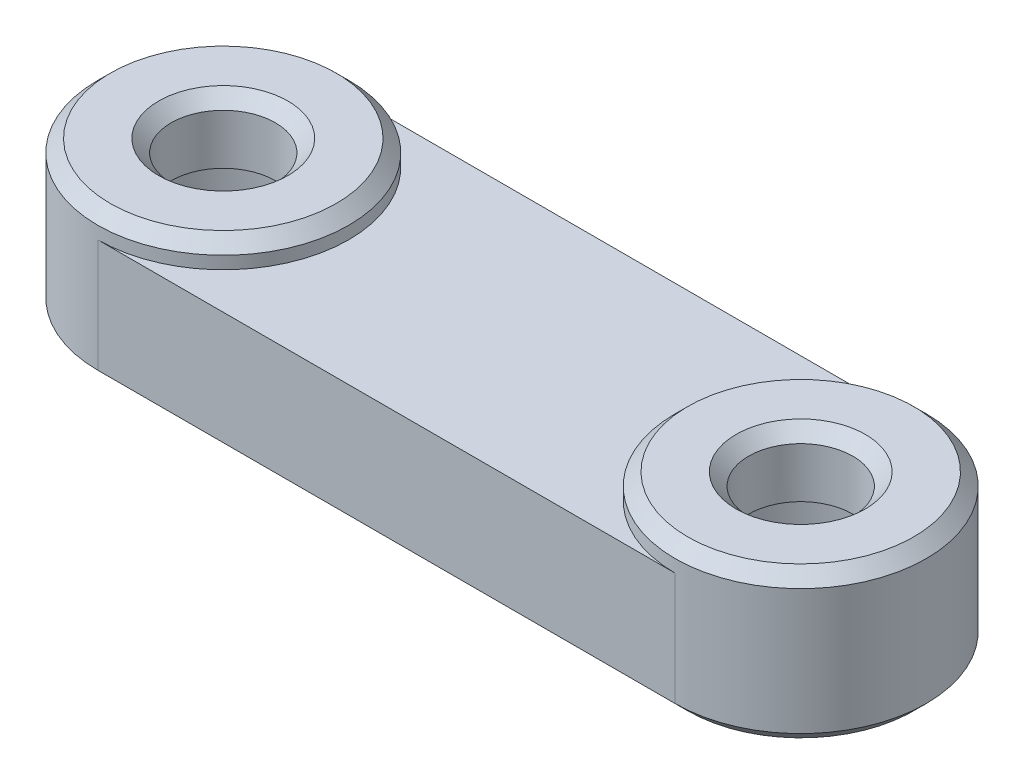
ISO-10303-21;
HEADER;
FILE_DESCRIPTION(('STEP AP214'),'2;1');
FILE_NAME('part.step','',(''),(''),'','','');
FILE_SCHEMA(('AUTOMOTIVE_DESIGN { 1 0 10303 214 1 1 1 1 }'));
ENDSEC;
DATA;
#1=APPLICATION_CONTEXT('core data for automotive mechanical design processes');
#2=APPLICATION_PROTOCOL_DEFINITION('international standard','automotive_design',2000,#1);
#3=PRODUCT_CONTEXT('',#1,'mechanical');
#4=PRODUCT('Part','Part','',(#3));
#5=PRODUCT_RELATED_PRODUCT_CATEGORY('part','',(#4));
#6=PRODUCT_DEFINITION_FORMATION('','',#4);
#7=PRODUCT_DEFINITION_CONTEXT('part definition',#1,'design');
#8=PRODUCT_DEFINITION('design','',#6,#7);
#9=PRODUCT_DEFINITION_SHAPE('','',#8);
#10=(LENGTH_UNIT() NAMED_UNIT(*) SI_UNIT(.MILLI.,.METRE.));
#11=(NAMED_UNIT(*) PLANE_ANGLE_UNIT() SI_UNIT($,.RADIAN.));
#12=(NAMED_UNIT(*) SI_UNIT($,.STERADIAN.) SOLID_ANGLE_UNIT());
#13=UNCERTAINTY_MEASURE_WITH_UNIT(LENGTH_MEASURE(1.E-05),#10,'distance_accuracy_value','');
#14=(GEOMETRIC_REPRESENTATION_CONTEXT(3) GLOBAL_UNCERTAINTY_ASSIGNED_CONTEXT((#13)) GLOBAL_UNIT_ASSIGNED_CONTEXT((#10,
#11,#12)) REPRESENTATION_CONTEXT('',''));
#15=CARTESIAN_POINT('',(0.,0.,0.));
#16=DIRECTION('',(0.,0.,1.));
#17=DIRECTION('',(1.,0.,0.));
#18=AXIS2_PLACEMENT_3D('',#15,#16,#17);
#19=CARTESIAN_POINT('',(0.,6.,5.));
#20=DIRECTION('',(0.,0.,-1.));
#21=DIRECTION('',(-1.,0.,0.));
#22=AXIS2_PLACEMENT_3D('',#19,#20,#21);
#23=PLANE('',#22);
#24=DIRECTION('',(0.,-1.,0.));
#25=VECTOR('',#24,1.);
#26=CARTESIAN_POINT('',(0.,6.,5.));
#27=LINE('',#26,#25);
#28=CARTESIAN_POINT('',(0.,5.,5.));
#29=VERTEX_POINT('',#28);
#30=CARTESIAN_POINT('',(0.,0.5,5.));
#31=VERTEX_POINT('',#30);
#32=EDGE_CURVE('E120',#29,#31,#27,.T.);
#33=ORIENTED_EDGE('',*,*,#32,.T.);
#34=DIRECTION('',(1.,0.,0.));
#35=VECTOR('',#34,1.);
#36=CARTESIAN_POINT('',(0.,0.5,5.));
#37=LINE('',#36,#35);
#38=CARTESIAN_POINT('',(23.,0.5,5.));
#39=VERTEX_POINT('',#38);
#40=EDGE_CURVE('E11',#31,#39,#37,.T.);
#41=ORIENTED_EDGE('',*,*,#40,.T.);
#42=DIRECTION('',(0.,-1.,0.));
#43=VECTOR('',#42,1.);
#44=CARTESIAN_POINT('',(23.,6.,5.));
#45=LINE('',#44,#43);
#46=CARTESIAN_POINT('',(23.,5.,5.));
#47=VERTEX_POINT('',#46);
#48=EDGE_CURVE('E114',#47,#39,#45,.T.);
#49=ORIENTED_EDGE('',*,*,#48,.F.);
#50=DIRECTION('',(1.,0.,0.));
#51=VECTOR('',#50,1.);
#52=CARTESIAN_POINT('',(0.,5.,5.));
#53=LINE('',#52,#51);
#54=EDGE_CURVE('E97',#29,#47,#53,.T.);
#55=ORIENTED_EDGE('',*,*,#54,.F.);
#56=EDGE_LOOP('',(#33,#41,#49,#55));
#57=FACE_BOUND('',#56,.T.);
#58=ADVANCED_FACE('F41',(#57),#23,.F.);
#59=CARTESIAN_POINT('',(0.,6.,-5.));
#60=DIRECTION('',(0.,0.,1.));
#61=DIRECTION('',(1.,0.,0.));
#62=AXIS2_PLACEMENT_3D('',#59,#60,#61);
#63=PLANE('',#62);
#64=DIRECTION('',(0.,-1.,0.));
#65=VECTOR('',#64,1.);
#66=CARTESIAN_POINT('',(23.,6.,-5.));
#67=LINE('',#66,#65);
#68=CARTESIAN_POINT('',(23.,5.,-5.));
#69=VERTEX_POINT('',#68);
#70=CARTESIAN_POINT('',(23.,0.5,-5.));
#71=VERTEX_POINT('',#70);
#72=EDGE_CURVE('E117',#69,#71,#67,.T.);
#73=ORIENTED_EDGE('',*,*,#72,.T.);
#74=DIRECTION('',(-1.,0.,0.));
#75=VECTOR('',#74,1.);
#76=CARTESIAN_POINT('',(0.,0.5,-5.));
#77=LINE('',#76,#75);
#78=CARTESIAN_POINT('',(0.,0.5,-5.));
#79=VERTEX_POINT('',#78);
#80=EDGE_CURVE('E157',#71,#79,#77,.T.);
#81=ORIENTED_EDGE('',*,*,#80,.T.);
#82=DIRECTION('',(0.,-1.,0.));
#83=VECTOR('',#82,1.);
#84=CARTESIAN_POINT('',(0.,6.,-5.));
#85=LINE('',#84,#83);
#86=CARTESIAN_POINT('',(0.,5.,-5.));
#87=VERTEX_POINT('',#86);
#88=EDGE_CURVE('E124',#87,#79,#85,.T.);
#89=ORIENTED_EDGE('',*,*,#88,.F.);
#90=DIRECTION('',(-1.,0.,0.));
#91=VECTOR('',#90,1.);
#92=CARTESIAN_POINT('',(0.,5.,-5.));
#93=LINE('',#92,#91);
#94=EDGE_CURVE('E122',#69,#87,#93,.T.);
#95=ORIENTED_EDGE('',*,*,#94,.F.);
#96=EDGE_LOOP('',(#73,#81,#89,#95));
#97=FACE_BOUND('',#96,.T.);
#98=ADVANCED_FACE('F188',(#97),#63,.F.);
#99=CARTESIAN_POINT('',(0.,6.,0.));
#100=DIRECTION('',(0.,1.,0.));
#101=DIRECTION('',(0.,0.,1.));
#102=AXIS2_PLACEMENT_3D('',#99,#100,#101);
#103=PLANE('',#102);
#104=CARTESIAN_POINT('',(0.,6.,0.));
#105=DIRECTION('',(0.,1.,0.));
#106=DIRECTION('',(0.,0.,1.));
#107=AXIS2_PLACEMENT_3D('',#104,#105,#106);
#108=CIRCLE('',#107,4.50000000000001);
#109=CARTESIAN_POINT('',(0.,6.,4.50000000000001));
#110=VERTEX_POINT('',#109);
#111=EDGE_CURVE('E146',#110,#110,#108,.T.);
#112=ORIENTED_EDGE('',*,*,#111,.T.);
#113=EDGE_LOOP('',(#112));
#114=FACE_BOUND('',#113,.T.);
#115=CARTESIAN_POINT('',(0.,6.,0.));
#116=DIRECTION('',(0.,1.,0.));
#117=DIRECTION('',(0.,0.,1.));
#118=AXIS2_PLACEMENT_3D('',#115,#116,#117);
#119=CIRCLE('',#118,2.575);
#120=CARTESIAN_POINT('',(0.,6.,2.575));
#121=VERTEX_POINT('',#120);
#122=EDGE_CURVE('E143',#121,#121,#119,.F.);
#123=ORIENTED_EDGE('',*,*,#122,.T.);
#124=EDGE_LOOP('',(#123));
#125=FACE_BOUND('',#124,.T.);
#126=ADVANCED_FACE('F233',(#114,#125),#103,.T.);
#127=CARTESIAN_POINT('',(23.,6.,0.));
#128=DIRECTION('',(0.,1.,0.));
#129=DIRECTION('',(0.,0.,1.));
#130=AXIS2_PLACEMENT_3D('',#127,#128,#129);
#131=CIRCLE('',#130,4.50000000000001);
#132=CARTESIAN_POINT('',(23.,6.,4.50000000000001));
#133=VERTEX_POINT('',#132);
#134=EDGE_CURVE('E132',#133,#133,#131,.T.);
#135=ORIENTED_EDGE('',*,*,#134,.T.);
#136=EDGE_LOOP('',(#135));
#137=FACE_BOUND('',#136,.T.);
#138=CARTESIAN_POINT('',(23.,6.,0.));
#139=DIRECTION('',(0.,1.,0.));
#140=DIRECTION('',(0.,0.,1.));
#141=AXIS2_PLACEMENT_3D('',#138,#139,#140);
#142=CIRCLE('',#141,2.575);
#143=CARTESIAN_POINT('',(23.,6.,2.575));
#144=VERTEX_POINT('',#143);
#145=EDGE_CURVE('E129',#144,#144,#142,.F.);
#146=ORIENTED_EDGE('',*,*,#145,.T.);
#147=EDGE_LOOP('',(#146));
#148=FACE_BOUND('',#147,.T.);
#149=ADVANCED_FACE('F239',(#137,#148),#103,.T.);
#150=CARTESIAN_POINT('',(0.,6.,0.));
#151=DIRECTION('',(0.,-1.,0.));
#152=DIRECTION('',(0.,0.,-1.));
#153=AXIS2_PLACEMENT_3D('',#150,#151,#152);
#154=CYLINDRICAL_SURFACE('',#153,5.);
#155=CARTESIAN_POINT('',(0.,5.5,0.));
#156=DIRECTION('',(0.,1.,0.));
#157=DIRECTION('',(0.,0.,1.));
#158=AXIS2_PLACEMENT_3D('',#155,#156,#157);
#159=CIRCLE('',#158,5.);
#160=CARTESIAN_POINT('',(0.,5.5,5.));
#161=VERTEX_POINT('',#160);
#162=EDGE_CURVE('E151',#161,#161,#159,.F.);
#163=ORIENTED_EDGE('',*,*,#162,.T.);
#164=EDGE_LOOP('',(#163));
#165=FACE_BOUND('',#164,.T.);
#166=ORIENTED_EDGE('',*,*,#88,.T.);
#167=CARTESIAN_POINT('',(0.,0.5,0.));
#168=DIRECTION('',(0.,1.,0.));
#169=DIRECTION('',(0.,0.,1.));
#170=AXIS2_PLACEMENT_3D('',#167,#168,#169);
#171=CIRCLE('',#170,5.);
#172=EDGE_CURVE('E149',#79,#31,#171,.T.);
#173=ORIENTED_EDGE('',*,*,#172,.T.);
#174=ORIENTED_EDGE('',*,*,#32,.F.);
#175=CARTESIAN_POINT('',(0.,5.,0.));
#176=DIRECTION('',(0.,1.,0.));
#177=DIRECTION('',(0.,0.,1.));
#178=AXIS2_PLACEMENT_3D('',#175,#176,#177);
#179=CIRCLE('',#178,5.);
#180=EDGE_CURVE('E103',#29,#87,#179,.T.);
#181=ORIENTED_EDGE('',*,*,#180,.T.);
#182=EDGE_LOOP('',(#166,#173,#174,#181));
#183=FACE_BOUND('',#182,.T.);
#184=ADVANCED_FACE('F189',(#165,#183),#154,.T.);
#185=CARTESIAN_POINT('',(23.,6.,0.));
#186=DIRECTION('',(0.,-1.,0.));
#187=DIRECTION('',(0.,0.,-1.));
#188=AXIS2_PLACEMENT_3D('',#185,#186,#187);
#189=CYLINDRICAL_SURFACE('',#188,5.);
#190=CARTESIAN_POINT('',(23.,5.5,0.));
#191=DIRECTION('',(0.,1.,0.));
#192=DIRECTION('',(0.,0.,1.));
#193=AXIS2_PLACEMENT_3D('',#190,#191,#192);
#194=CIRCLE('',#193,5.);
#195=CARTESIAN_POINT('',(23.,5.5,5.));
#196=VERTEX_POINT('',#195);
#197=EDGE_CURVE('E137',#196,#196,#194,.F.);
#198=ORIENTED_EDGE('',*,*,#197,.T.);
#199=EDGE_LOOP('',(#198));
#200=FACE_BOUND('',#199,.T.);
#201=ORIENTED_EDGE('',*,*,#48,.T.);
#202=CARTESIAN_POINT('',(23.,0.5,0.));
#203=DIRECTION('',(0.,1.,0.));
#204=DIRECTION('',(0.,0.,1.));
#205=AXIS2_PLACEMENT_3D('',#202,#203,#204);
#206=CIRCLE('',#205,5.);
#207=EDGE_CURVE('E135',#39,#71,#206,.T.);
#208=ORIENTED_EDGE('',*,*,#207,.T.);
#209=ORIENTED_EDGE('',*,*,#72,.F.);
#210=CARTESIAN_POINT('',(23.,5.,0.));
#211=DIRECTION('',(0.,1.,0.));
#212=DIRECTION('',(0.,0.,1.));
#213=AXIS2_PLACEMENT_3D('',#210,#211,#212);
#214=CIRCLE('',#213,5.);
#215=EDGE_CURVE('E100',#69,#47,#214,.T.);
#216=ORIENTED_EDGE('',*,*,#215,.T.);
#217=EDGE_LOOP('',(#201,#208,#209,#216));
#218=FACE_BOUND('',#217,.T.);
#219=ADVANCED_FACE('F113',(#200,#218),#189,.T.);
#220=CARTESIAN_POINT('',(0.,0.,0.));
#221=DIRECTION('',(0.,1.,0.));
#222=DIRECTION('',(0.,0.,1.));
#223=AXIS2_PLACEMENT_3D('',#220,#221,#222);
#224=PLANE('',#223);
#225=CARTESIAN_POINT('',(0.,0.,0.));
#226=DIRECTION('',(0.,1.,0.));
#227=DIRECTION('',(0.,0.,1.));
#228=AXIS2_PLACEMENT_3D('',#225,#226,#227);
#229=CIRCLE('',#228,4.5);
#230=CARTESIAN_POINT('',(0.,0.,4.5));
#231=VERTEX_POINT('',#230);
#232=CARTESIAN_POINT('',(0.,0.,-4.5));
#233=VERTEX_POINT('',#232);
#234=EDGE_CURVE('E59',#231,#233,#229,.F.);
#235=ORIENTED_EDGE('',*,*,#234,.T.);
#236=DIRECTION('',(1.,0.,0.));
#237=VECTOR('',#236,1.);
#238=CARTESIAN_POINT('',(0.,0.,-4.5));
#239=LINE('',#238,#237);
#240=CARTESIAN_POINT('',(23.,0.,-4.5));
#241=VERTEX_POINT('',#240);
#242=EDGE_CURVE('E51',#233,#241,#239,.T.);
#243=ORIENTED_EDGE('',*,*,#242,.T.);
#244=CARTESIAN_POINT('',(23.,0.,0.));
#245=DIRECTION('',(0.,1.,0.));
#246=DIRECTION('',(0.,0.,1.));
#247=AXIS2_PLACEMENT_3D('',#244,#245,#246);
#248=CIRCLE('',#247,4.5);
#249=CARTESIAN_POINT('',(23.,0.,4.5));
#250=VERTEX_POINT('',#249);
#251=EDGE_CURVE('E162',#241,#250,#248,.F.);
#252=ORIENTED_EDGE('',*,*,#251,.T.);
#253=DIRECTION('',(-1.,0.,0.));
#254=VECTOR('',#253,1.);
#255=CARTESIAN_POINT('',(0.,0.,4.5));
#256=LINE('',#255,#254);
#257=EDGE_CURVE('E160',#250,#231,#256,.T.);
#258=ORIENTED_EDGE('',*,*,#257,.T.);
#259=EDGE_LOOP('',(#235,#243,#252,#258));
#260=FACE_BOUND('',#259,.T.);
#261=CARTESIAN_POINT('',(23.,0.,0.));
#262=DIRECTION('',(0.,-1.,0.));
#263=DIRECTION('',(0.,0.,-1.));
#264=AXIS2_PLACEMENT_3D('',#261,#262,#263);
#265=CIRCLE('',#264,3.75);
#266=CARTESIAN_POINT('',(23.,0.,-3.75));
#267=VERTEX_POINT('',#266);
#268=EDGE_CURVE('E200',#267,#267,#265,.T.);
#269=ORIENTED_EDGE('',*,*,#268,.F.);
#270=EDGE_LOOP('',(#269));
#271=FACE_BOUND('',#270,.T.);
#272=CARTESIAN_POINT('',(0.,0.,0.));
#273=DIRECTION('',(0.,-1.,0.));
#274=DIRECTION('',(0.,0.,-1.));
#275=AXIS2_PLACEMENT_3D('',#272,#273,#274);
#276=CIRCLE('',#275,3.75);
#277=CARTESIAN_POINT('',(0.,0.,-3.75));
#278=VERTEX_POINT('',#277);
#279=EDGE_CURVE('E190',#278,#278,#276,.T.);
#280=ORIENTED_EDGE('',*,*,#279,.F.);
#281=EDGE_LOOP('',(#280));
#282=FACE_BOUND('',#281,.T.);
#283=ADVANCED_FACE('F179',(#260,#271,#282),#224,.F.);
#284=CARTESIAN_POINT('',(0.,0.,0.));
#285=DIRECTION('',(0.,-1.,0.));
#286=DIRECTION('',(0.,0.,-1.));
#287=AXIS2_PLACEMENT_3D('',#284,#285,#286);
#288=CYLINDRICAL_SURFACE('',#287,3.75);
#289=ORIENTED_EDGE('',*,*,#279,.T.);
#290=EDGE_LOOP('',(#289));
#291=FACE_BOUND('',#290,.T.);
#292=CARTESIAN_POINT('',(0.,3.5,0.));
#293=DIRECTION('',(0.,-1.,0.));
#294=DIRECTION('',(0.,0.,-1.));
#295=AXIS2_PLACEMENT_3D('',#292,#293,#294);
#296=CIRCLE('',#295,3.75);
#297=CARTESIAN_POINT('',(0.,3.5,-3.75));
#298=VERTEX_POINT('',#297);
#299=EDGE_CURVE('E192',#298,#298,#296,.T.);
#300=ORIENTED_EDGE('',*,*,#299,.F.);
#301=EDGE_LOOP('',(#300));
#302=FACE_BOUND('',#301,.T.);
#303=ADVANCED_FACE('F362',(#291,#302),#288,.F.);
#304=CARTESIAN_POINT('',(-3.75,3.5,0.));
#305=DIRECTION('',(0.,-1.,0.));
#306=DIRECTION('',(0.,0.,-1.));
#307=AXIS2_PLACEMENT_3D('',#304,#305,#306);
#308=PLANE('',#307);
#309=ORIENTED_EDGE('',*,*,#299,.T.);
#310=EDGE_LOOP('',(#309));
#311=FACE_BOUND('',#310,.T.);
#312=CARTESIAN_POINT('',(0.,3.5,0.));
#313=DIRECTION('',(0.,-1.,0.));
#314=DIRECTION('',(0.,0.,-1.));
#315=AXIS2_PLACEMENT_3D('',#312,#313,#314);
#316=CIRCLE('',#315,2.075);
#317=CARTESIAN_POINT('',(0.,3.5,-2.075));
#318=VERTEX_POINT('',#317);
#319=EDGE_CURVE('E197',#318,#318,#316,.T.);
#320=ORIENTED_EDGE('',*,*,#319,.F.);
#321=EDGE_LOOP('',(#320));
#322=FACE_BOUND('',#321,.T.);
#323=ADVANCED_FACE('F354',(#311,#322),#308,.T.);
#324=CARTESIAN_POINT('',(0.,0.,0.));
#325=DIRECTION('',(0.,-1.,0.));
#326=DIRECTION('',(0.,0.,-1.));
#327=AXIS2_PLACEMENT_3D('',#324,#325,#326);
#328=CYLINDRICAL_SURFACE('',#327,2.075);
#329=CARTESIAN_POINT('',(0.,5.5,0.));
#330=DIRECTION('',(0.,1.,0.));
#331=DIRECTION('',(0.,0.,1.));
#332=AXIS2_PLACEMENT_3D('',#329,#330,#331);
#333=CIRCLE('',#332,2.075);
#334=CARTESIAN_POINT('',(0.,5.5,2.075));
#335=VERTEX_POINT('',#334);
#336=EDGE_CURVE('E154',#335,#335,#333,.T.);
#337=ORIENTED_EDGE('',*,*,#336,.T.);
#338=EDGE_LOOP('',(#337));
#339=FACE_BOUND('',#338,.T.);
#340=ORIENTED_EDGE('',*,*,#319,.T.);
#341=EDGE_LOOP('',(#340));
#342=FACE_BOUND('',#341,.T.);
#343=ADVANCED_FACE('F224',(#339,#342),#328,.F.);
#344=CARTESIAN_POINT('',(23.,0.,0.));
#345=DIRECTION('',(0.,-1.,0.));
#346=DIRECTION('',(0.,0.,-1.));
#347=AXIS2_PLACEMENT_3D('',#344,#345,#346);
#348=CYLINDRICAL_SURFACE('',#347,3.75);
#349=ORIENTED_EDGE('',*,*,#268,.T.);
#350=EDGE_LOOP('',(#349));
#351=FACE_BOUND('',#350,.T.);
#352=CARTESIAN_POINT('',(23.,3.5,0.));
#353=DIRECTION('',(0.,-1.,0.));
#354=DIRECTION('',(0.,0.,-1.));
#355=AXIS2_PLACEMENT_3D('',#352,#353,#354);
#356=CIRCLE('',#355,3.75);
#357=CARTESIAN_POINT('',(23.,3.5,-3.75));
#358=VERTEX_POINT('',#357);
#359=EDGE_CURVE('E203',#358,#358,#356,.T.);
#360=ORIENTED_EDGE('',*,*,#359,.F.);
#361=EDGE_LOOP('',(#360));
#362=FACE_BOUND('',#361,.T.);
#363=ADVANCED_FACE('F214',(#351,#362),#348,.F.);
#364=CARTESIAN_POINT('',(19.25,3.5,0.));
#365=DIRECTION('',(0.,-1.,0.));
#366=DIRECTION('',(0.,0.,-1.));
#367=AXIS2_PLACEMENT_3D('',#364,#365,#366);
#368=PLANE('',#367);
#369=ORIENTED_EDGE('',*,*,#359,.T.);
#370=EDGE_LOOP('',(#369));
#371=FACE_BOUND('',#370,.T.);
#372=CARTESIAN_POINT('',(23.,3.5,0.));
#373=DIRECTION('',(0.,-1.,0.));
#374=DIRECTION('',(0.,0.,-1.));
#375=AXIS2_PLACEMENT_3D('',#372,#373,#374);
#376=CIRCLE('',#375,2.075);
#377=CARTESIAN_POINT('',(23.,3.5,-2.075));
#378=VERTEX_POINT('',#377);
#379=EDGE_CURVE('E108',#378,#378,#376,.T.);
#380=ORIENTED_EDGE('',*,*,#379,.F.);
#381=EDGE_LOOP('',(#380));
#382=FACE_BOUND('',#381,.T.);
#383=ADVANCED_FACE('F212',(#371,#382),#368,.T.);
#384=CARTESIAN_POINT('',(23.,0.,0.));
#385=DIRECTION('',(0.,-1.,0.));
#386=DIRECTION('',(0.,0.,-1.));
#387=AXIS2_PLACEMENT_3D('',#384,#385,#386);
#388=CYLINDRICAL_SURFACE('',#387,2.075);
#389=CARTESIAN_POINT('',(23.,5.5,0.));
#390=DIRECTION('',(0.,1.,0.));
#391=DIRECTION('',(0.,0.,1.));
#392=AXIS2_PLACEMENT_3D('',#389,#390,#391);
#393=CIRCLE('',#392,2.075);
#394=CARTESIAN_POINT('',(23.,5.5,2.075));
#395=VERTEX_POINT('',#394);
#396=EDGE_CURVE('E140',#395,#395,#393,.T.);
#397=ORIENTED_EDGE('',*,*,#396,.T.);
#398=EDGE_LOOP('',(#397));
#399=FACE_BOUND('',#398,.T.);
#400=ORIENTED_EDGE('',*,*,#379,.T.);
#401=EDGE_LOOP('',(#400));
#402=FACE_BOUND('',#401,.T.);
#403=ADVANCED_FACE('F210',(#399,#402),#388,.F.);
#404=CARTESIAN_POINT('',(0.,5.,0.));
#405=DIRECTION('',(0.,1.,0.));
#406=DIRECTION('',(0.,0.,1.));
#407=AXIS2_PLACEMENT_3D('',#404,#405,#406);
#408=PLANE('',#407);
#409=ORIENTED_EDGE('',*,*,#54,.T.);
#410=ORIENTED_EDGE('',*,*,#215,.F.);
#411=ORIENTED_EDGE('',*,*,#94,.T.);
#412=ORIENTED_EDGE('',*,*,#180,.F.);
#413=EDGE_LOOP('',(#409,#410,#411,#412));
#414=FACE_BOUND('',#413,.T.);
#415=ADVANCED_FACE('F99',(#414),#408,.T.);
#416=CARTESIAN_POINT('',(23.,6.,0.));
#417=DIRECTION('',(0.,-1.,0.));
#418=DIRECTION('',(0.,0.,-1.));
#419=AXIS2_PLACEMENT_3D('',#416,#417,#418);
#420=CONICAL_SURFACE('',#419,4.50000000000001,0.785398163397445);
#421=ORIENTED_EDGE('',*,*,#197,.F.);
#422=EDGE_LOOP('',(#421));
#423=FACE_BOUND('',#422,.T.);
#424=ORIENTED_EDGE('',*,*,#134,.F.);
#425=EDGE_LOOP('',(#424));
#426=FACE_BOUND('',#425,.T.);
#427=ADVANCED_FACE('F242',(#423,#426),#420,.T.);
#428=CARTESIAN_POINT('',(23.,6.,0.));
#429=DIRECTION('',(0.,1.,0.));
#430=DIRECTION('',(0.,0.,1.));
#431=AXIS2_PLACEMENT_3D('',#428,#429,#430);
#432=CONICAL_SURFACE('',#431,2.575,0.785398163397445);
#433=ORIENTED_EDGE('',*,*,#396,.F.);
#434=EDGE_LOOP('',(#433));
#435=FACE_BOUND('',#434,.T.);
#436=ORIENTED_EDGE('',*,*,#145,.F.);
#437=EDGE_LOOP('',(#436));
#438=FACE_BOUND('',#437,.T.);
#439=ADVANCED_FACE('F248',(#435,#438),#432,.F.);
#440=CARTESIAN_POINT('',(0.,6.,0.));
#441=DIRECTION('',(0.,-1.,0.));
#442=DIRECTION('',(0.,0.,-1.));
#443=AXIS2_PLACEMENT_3D('',#440,#441,#442);
#444=CONICAL_SURFACE('',#443,4.50000000000001,0.785398163397445);
#445=ORIENTED_EDGE('',*,*,#162,.F.);
#446=EDGE_LOOP('',(#445));
#447=FACE_BOUND('',#446,.T.);
#448=ORIENTED_EDGE('',*,*,#111,.F.);
#449=EDGE_LOOP('',(#448));
#450=FACE_BOUND('',#449,.T.);
#451=ADVANCED_FACE('F255',(#447,#450),#444,.T.);
#452=CARTESIAN_POINT('',(0.,6.,0.));
#453=DIRECTION('',(0.,1.,0.));
#454=DIRECTION('',(0.,0.,1.));
#455=AXIS2_PLACEMENT_3D('',#452,#453,#454);
#456=CONICAL_SURFACE('',#455,2.575,0.785398163397449);
#457=ORIENTED_EDGE('',*,*,#336,.F.);
#458=EDGE_LOOP('',(#457));
#459=FACE_BOUND('',#458,.T.);
#460=ORIENTED_EDGE('',*,*,#122,.F.);
#461=EDGE_LOOP('',(#460));
#462=FACE_BOUND('',#461,.T.);
#463=ADVANCED_FACE('F262',(#459,#462),#456,.F.);
#464=CARTESIAN_POINT('',(0.,0.5,5.));
#465=DIRECTION('',(0.,0.70710678118655,-0.707106781186545));
#466=DIRECTION('',(1.,0.,0.));
#467=AXIS2_PLACEMENT_3D('',#464,#465,#466);
#468=PLANE('',#467);
#469=DIRECTION('',(0.,0.707106781186545,0.70710678118655));
#470=VECTOR('',#469,1.);
#471=CARTESIAN_POINT('',(0.,0.,4.5));
#472=LINE('',#471,#470);
#473=EDGE_CURVE('E168',#231,#31,#472,.T.);
#474=ORIENTED_EDGE('',*,*,#473,.F.);
#475=ORIENTED_EDGE('',*,*,#257,.F.);
#476=DIRECTION('',(0.,-0.707106781186545,-0.70710678118655));
#477=VECTOR('',#476,1.);
#478=CARTESIAN_POINT('',(23.,0.5,5.));
#479=LINE('',#478,#477);
#480=EDGE_CURVE('E46',#39,#250,#479,.T.);
#481=ORIENTED_EDGE('',*,*,#480,.F.);
#482=ORIENTED_EDGE('',*,*,#40,.F.);
#483=EDGE_LOOP('',(#474,#475,#481,#482));
#484=FACE_BOUND('',#483,.T.);
#485=ADVANCED_FACE('F44',(#484),#468,.F.);
#486=CARTESIAN_POINT('',(23.,0.5,0.));
#487=DIRECTION('',(0.,1.,0.));
#488=DIRECTION('',(0.,0.,1.));
#489=AXIS2_PLACEMENT_3D('',#486,#487,#488);
#490=CONICAL_SURFACE('',#489,5.,0.785398163397452);
#491=ORIENTED_EDGE('',*,*,#480,.T.);
#492=ORIENTED_EDGE('',*,*,#251,.F.);
#493=DIRECTION('',(0.,-0.707106781186545,0.70710678118655));
#494=VECTOR('',#493,1.);
#495=CARTESIAN_POINT('',(23.,0.5,-5.));
#496=LINE('',#495,#494);
#497=EDGE_CURVE('E66',#71,#241,#496,.T.);
#498=ORIENTED_EDGE('',*,*,#497,.F.);
#499=ORIENTED_EDGE('',*,*,#207,.F.);
#500=EDGE_LOOP('',(#491,#492,#498,#499));
#501=FACE_BOUND('',#500,.T.);
#502=ADVANCED_FACE('F176',(#501),#490,.T.);
#503=CARTESIAN_POINT('',(0.,0.5,0.));
#504=DIRECTION('',(0.,1.,0.));
#505=DIRECTION('',(0.,0.,1.));
#506=AXIS2_PLACEMENT_3D('',#503,#504,#505);
#507=CONICAL_SURFACE('',#506,5.,0.785398163397452);
#508=ORIENTED_EDGE('',*,*,#473,.T.);
#509=ORIENTED_EDGE('',*,*,#172,.F.);
#510=DIRECTION('',(0.,0.707106781186545,-0.70710678118655));
#511=VECTOR('',#510,1.);
#512=CARTESIAN_POINT('',(0.,0.,-4.5));
#513=LINE('',#512,#511);
#514=EDGE_CURVE('E166',#233,#79,#513,.T.);
#515=ORIENTED_EDGE('',*,*,#514,.F.);
#516=ORIENTED_EDGE('',*,*,#234,.F.);
#517=EDGE_LOOP('',(#508,#509,#515,#516));
#518=FACE_BOUND('',#517,.T.);
#519=ADVANCED_FACE('F183',(#518),#507,.T.);
#520=CARTESIAN_POINT('',(0.,0.5,-5.));
#521=DIRECTION('',(0.,0.70710678118655,0.707106781186545));
#522=DIRECTION('',(-1.,0.,0.));
#523=AXIS2_PLACEMENT_3D('',#520,#521,#522);
#524=PLANE('',#523);
#525=ORIENTED_EDGE('',*,*,#497,.T.);
#526=ORIENTED_EDGE('',*,*,#242,.F.);
#527=ORIENTED_EDGE('',*,*,#514,.T.);
#528=ORIENTED_EDGE('',*,*,#80,.F.);
#529=EDGE_LOOP('',(#525,#526,#527,#528));
#530=FACE_BOUND('',#529,.T.);
#531=ADVANCED_FACE('F182',(#530),#524,.F.);
#532=CLOSED_SHELL('',(#58,#98,#126,#149,#184,#219,#283,#303,#323,#343,#363,#383,#403,#415,#427,
#439,#451,#463,#485,#502,#519,#531));
#533=MANIFOLD_SOLID_BREP('B2',#532);
#534=ADVANCED_BREP_SHAPE_REPRESENTATION('',(#18,#533),#14);
#535=SHAPE_DEFINITION_REPRESENTATION(#9,#534);
ENDSEC;
END-ISO-10303-21;
